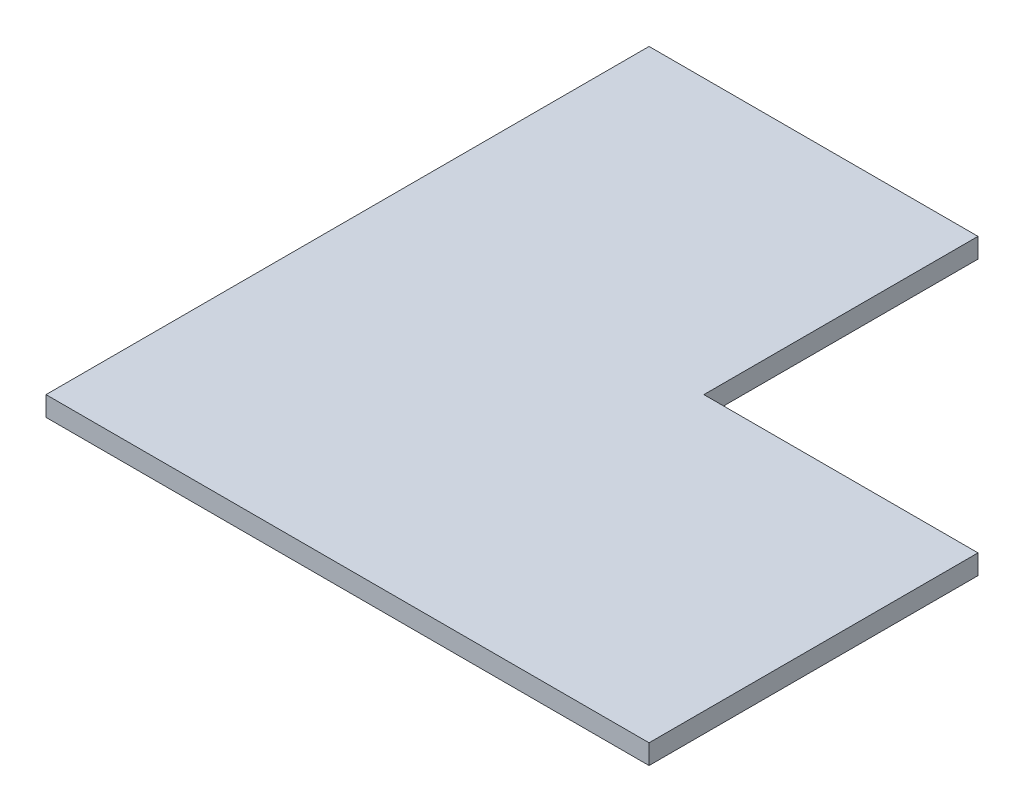
ISO-10303-21;
HEADER;
FILE_DESCRIPTION(('STEP AP214'),'2;1');
FILE_NAME('part.step','',(''),(''),'','','');
FILE_SCHEMA(('AUTOMOTIVE_DESIGN { 1 0 10303 214 1 1 1 1 }'));
ENDSEC;
DATA;
#1=APPLICATION_CONTEXT('core data for automotive mechanical design processes');
#2=APPLICATION_PROTOCOL_DEFINITION('international standard','automotive_design',2000,#1);
#3=PRODUCT_CONTEXT('',#1,'mechanical');
#4=PRODUCT('Part','Part','',(#3));
#5=PRODUCT_RELATED_PRODUCT_CATEGORY('part','',(#4));
#6=PRODUCT_DEFINITION_FORMATION('','',#4);
#7=PRODUCT_DEFINITION_CONTEXT('part definition',#1,'design');
#8=PRODUCT_DEFINITION('design','',#6,#7);
#9=PRODUCT_DEFINITION_SHAPE('','',#8);
#10=(LENGTH_UNIT() NAMED_UNIT(*) SI_UNIT(.MILLI.,.METRE.));
#11=(NAMED_UNIT(*) PLANE_ANGLE_UNIT() SI_UNIT($,.RADIAN.));
#12=(NAMED_UNIT(*) SI_UNIT($,.STERADIAN.) SOLID_ANGLE_UNIT());
#13=UNCERTAINTY_MEASURE_WITH_UNIT(LENGTH_MEASURE(1.E-05),#10,'distance_accuracy_value','');
#14=(GEOMETRIC_REPRESENTATION_CONTEXT(3) GLOBAL_UNCERTAINTY_ASSIGNED_CONTEXT((#13)) GLOBAL_UNIT_ASSIGNED_CONTEXT((#10,
#11,#12)) REPRESENTATION_CONTEXT('',''));
#15=CARTESIAN_POINT('',(0.,0.,0.));
#16=DIRECTION('',(0.,0.,1.));
#17=DIRECTION('',(1.,0.,0.));
#18=AXIS2_PLACEMENT_3D('',#15,#16,#17);
#19=CARTESIAN_POINT('',(550.,18.,0.));
#20=DIRECTION('',(0.,0.,-1.));
#21=DIRECTION('',(-1.,0.,0.));
#22=AXIS2_PLACEMENT_3D('',#19,#20,#21);
#23=PLANE('',#22);
#24=DIRECTION('',(1.,0.,0.));
#25=VECTOR('',#24,1.);
#26=CARTESIAN_POINT('',(550.,0.,0.));
#27=LINE('',#26,#25);
#28=CARTESIAN_POINT('',(0.,0.,0.));
#29=VERTEX_POINT('',#28);
#30=CARTESIAN_POINT('',(550.,0.,0.));
#31=VERTEX_POINT('',#30);
#32=EDGE_CURVE('E118',#29,#31,#27,.T.);
#33=ORIENTED_EDGE('',*,*,#32,.T.);
#34=DIRECTION('',(0.,-1.,0.));
#35=VECTOR('',#34,1.);
#36=CARTESIAN_POINT('',(550.,18.,0.));
#37=LINE('',#36,#35);
#38=CARTESIAN_POINT('',(550.,18.,0.));
#39=VERTEX_POINT('',#38);
#40=EDGE_CURVE('E11',#39,#31,#37,.T.);
#41=ORIENTED_EDGE('',*,*,#40,.F.);
#42=DIRECTION('',(1.,0.,0.));
#43=VECTOR('',#42,1.);
#44=CARTESIAN_POINT('',(550.,18.,0.));
#45=LINE('',#44,#43);
#46=CARTESIAN_POINT('',(0.,18.,0.));
#47=VERTEX_POINT('',#46);
#48=EDGE_CURVE('E128',#47,#39,#45,.T.);
#49=ORIENTED_EDGE('',*,*,#48,.F.);
#50=DIRECTION('',(0.,-1.,0.));
#51=VECTOR('',#50,1.);
#52=CARTESIAN_POINT('',(0.,18.,0.));
#53=LINE('',#52,#51);
#54=EDGE_CURVE('E114',#47,#29,#53,.T.);
#55=ORIENTED_EDGE('',*,*,#54,.T.);
#56=EDGE_LOOP('',(#33,#41,#49,#55));
#57=FACE_BOUND('',#56,.T.);
#58=ADVANCED_FACE('F34',(#57),#23,.F.);
#59=CARTESIAN_POINT('',(550.,18.,-300.));
#60=DIRECTION('',(-1.,0.,0.));
#61=DIRECTION('',(0.,0.,1.));
#62=AXIS2_PLACEMENT_3D('',#59,#60,#61);
#63=PLANE('',#62);
#64=DIRECTION('',(0.,0.,-1.));
#65=VECTOR('',#64,1.);
#66=CARTESIAN_POINT('',(550.,0.,-300.));
#67=LINE('',#66,#65);
#68=CARTESIAN_POINT('',(550.,0.,-300.));
#69=VERTEX_POINT('',#68);
#70=EDGE_CURVE('E121',#31,#69,#67,.T.);
#71=ORIENTED_EDGE('',*,*,#70,.T.);
#72=DIRECTION('',(0.,-1.,0.));
#73=VECTOR('',#72,1.);
#74=CARTESIAN_POINT('',(550.,18.,-300.));
#75=LINE('',#74,#73);
#76=CARTESIAN_POINT('',(550.,18.,-300.));
#77=VERTEX_POINT('',#76);
#78=EDGE_CURVE('E42',#77,#69,#75,.T.);
#79=ORIENTED_EDGE('',*,*,#78,.F.);
#80=DIRECTION('',(0.,0.,-1.));
#81=VECTOR('',#80,1.);
#82=CARTESIAN_POINT('',(550.,18.,-300.));
#83=LINE('',#82,#81);
#84=EDGE_CURVE('E87',#39,#77,#83,.T.);
#85=ORIENTED_EDGE('',*,*,#84,.F.);
#86=ORIENTED_EDGE('',*,*,#40,.T.);
#87=EDGE_LOOP('',(#71,#79,#85,#86));
#88=FACE_BOUND('',#87,.T.);
#89=ADVANCED_FACE('F152',(#88),#63,.F.);
#90=CARTESIAN_POINT('',(300.,18.,-300.));
#91=DIRECTION('',(0.,0.,1.));
#92=DIRECTION('',(1.,0.,0.));
#93=AXIS2_PLACEMENT_3D('',#90,#91,#92);
#94=PLANE('',#93);
#95=DIRECTION('',(-1.,0.,0.));
#96=VECTOR('',#95,1.);
#97=CARTESIAN_POINT('',(300.,0.,-300.));
#98=LINE('',#97,#96);
#99=CARTESIAN_POINT('',(300.,0.,-300.));
#100=VERTEX_POINT('',#99);
#101=EDGE_CURVE('E123',#69,#100,#98,.T.);
#102=ORIENTED_EDGE('',*,*,#101,.T.);
#103=DIRECTION('',(0.,-1.,0.));
#104=VECTOR('',#103,1.);
#105=CARTESIAN_POINT('',(300.,18.,-300.));
#106=LINE('',#105,#104);
#107=CARTESIAN_POINT('',(300.,18.,-300.));
#108=VERTEX_POINT('',#107);
#109=EDGE_CURVE('E109',#108,#100,#106,.T.);
#110=ORIENTED_EDGE('',*,*,#109,.F.);
#111=DIRECTION('',(-1.,0.,0.));
#112=VECTOR('',#111,1.);
#113=CARTESIAN_POINT('',(300.,18.,-300.));
#114=LINE('',#113,#112);
#115=EDGE_CURVE('E100',#77,#108,#114,.T.);
#116=ORIENTED_EDGE('',*,*,#115,.F.);
#117=ORIENTED_EDGE('',*,*,#78,.T.);
#118=EDGE_LOOP('',(#102,#110,#116,#117));
#119=FACE_BOUND('',#118,.T.);
#120=ADVANCED_FACE('F134',(#119),#94,.F.);
#121=CARTESIAN_POINT('',(300.,18.,-550.));
#122=DIRECTION('',(-1.,0.,0.));
#123=DIRECTION('',(0.,0.,1.));
#124=AXIS2_PLACEMENT_3D('',#121,#122,#123);
#125=PLANE('',#124);
#126=DIRECTION('',(0.,0.,-1.));
#127=VECTOR('',#126,1.);
#128=CARTESIAN_POINT('',(300.,0.,-550.));
#129=LINE('',#128,#127);
#130=CARTESIAN_POINT('',(300.,0.,-550.));
#131=VERTEX_POINT('',#130);
#132=EDGE_CURVE('E108',#100,#131,#129,.T.);
#133=ORIENTED_EDGE('',*,*,#132,.T.);
#134=DIRECTION('',(0.,-1.,0.));
#135=VECTOR('',#134,1.);
#136=CARTESIAN_POINT('',(300.,18.,-550.));
#137=LINE('',#136,#135);
#138=CARTESIAN_POINT('',(300.,18.,-550.));
#139=VERTEX_POINT('',#138);
#140=EDGE_CURVE('E105',#139,#131,#137,.T.);
#141=ORIENTED_EDGE('',*,*,#140,.F.);
#142=DIRECTION('',(0.,0.,-1.));
#143=VECTOR('',#142,1.);
#144=CARTESIAN_POINT('',(300.,18.,-550.));
#145=LINE('',#144,#143);
#146=EDGE_CURVE('E94',#108,#139,#145,.T.);
#147=ORIENTED_EDGE('',*,*,#146,.F.);
#148=ORIENTED_EDGE('',*,*,#109,.T.);
#149=EDGE_LOOP('',(#133,#141,#147,#148));
#150=FACE_BOUND('',#149,.T.);
#151=ADVANCED_FACE('F106',(#150),#125,.F.);
#152=CARTESIAN_POINT('',(0.,18.,-550.));
#153=DIRECTION('',(0.,0.,1.));
#154=DIRECTION('',(1.,0.,0.));
#155=AXIS2_PLACEMENT_3D('',#152,#153,#154);
#156=PLANE('',#155);
#157=DIRECTION('',(-1.,0.,0.));
#158=VECTOR('',#157,1.);
#159=CARTESIAN_POINT('',(0.,0.,-550.));
#160=LINE('',#159,#158);
#161=CARTESIAN_POINT('',(0.,0.,-550.));
#162=VERTEX_POINT('',#161);
#163=EDGE_CURVE('E73',#131,#162,#160,.T.);
#164=ORIENTED_EDGE('',*,*,#163,.T.);
#165=DIRECTION('',(0.,-1.,0.));
#166=VECTOR('',#165,1.);
#167=CARTESIAN_POINT('',(0.,18.,-550.));
#168=LINE('',#167,#166);
#169=CARTESIAN_POINT('',(0.,18.,-550.));
#170=VERTEX_POINT('',#169);
#171=EDGE_CURVE('E110',#170,#162,#168,.T.);
#172=ORIENTED_EDGE('',*,*,#171,.F.);
#173=DIRECTION('',(-1.,0.,0.));
#174=VECTOR('',#173,1.);
#175=CARTESIAN_POINT('',(0.,18.,-550.));
#176=LINE('',#175,#174);
#177=EDGE_CURVE('E98',#139,#170,#176,.T.);
#178=ORIENTED_EDGE('',*,*,#177,.F.);
#179=ORIENTED_EDGE('',*,*,#140,.T.);
#180=EDGE_LOOP('',(#164,#172,#178,#179));
#181=FACE_BOUND('',#180,.T.);
#182=ADVANCED_FACE('F112',(#181),#156,.F.);
#183=CARTESIAN_POINT('',(0.,18.,0.));
#184=DIRECTION('',(1.,0.,0.));
#185=DIRECTION('',(0.,0.,-1.));
#186=AXIS2_PLACEMENT_3D('',#183,#184,#185);
#187=PLANE('',#186);
#188=DIRECTION('',(0.,0.,1.));
#189=VECTOR('',#188,1.);
#190=CARTESIAN_POINT('',(0.,0.,0.));
#191=LINE('',#190,#189);
#192=EDGE_CURVE('E79',#162,#29,#191,.T.);
#193=ORIENTED_EDGE('',*,*,#192,.T.);
#194=ORIENTED_EDGE('',*,*,#54,.F.);
#195=DIRECTION('',(0.,0.,1.));
#196=VECTOR('',#195,1.);
#197=CARTESIAN_POINT('',(0.,18.,0.));
#198=LINE('',#197,#196);
#199=EDGE_CURVE('E50',#170,#47,#198,.T.);
#200=ORIENTED_EDGE('',*,*,#199,.F.);
#201=ORIENTED_EDGE('',*,*,#171,.T.);
#202=EDGE_LOOP('',(#193,#194,#200,#201));
#203=FACE_BOUND('',#202,.T.);
#204=ADVANCED_FACE('F141',(#203),#187,.F.);
#205=CARTESIAN_POINT('',(0.,18.,0.));
#206=DIRECTION('',(0.,-1.,0.));
#207=DIRECTION('',(0.,0.,-1.));
#208=AXIS2_PLACEMENT_3D('',#205,#206,#207);
#209=PLANE('',#208);
#210=ORIENTED_EDGE('',*,*,#48,.T.);
#211=ORIENTED_EDGE('',*,*,#84,.T.);
#212=ORIENTED_EDGE('',*,*,#115,.T.);
#213=ORIENTED_EDGE('',*,*,#146,.T.);
#214=ORIENTED_EDGE('',*,*,#177,.T.);
#215=ORIENTED_EDGE('',*,*,#199,.T.);
#216=EDGE_LOOP('',(#210,#211,#212,#213,#214,#215));
#217=FACE_BOUND('',#216,.T.);
#218=ADVANCED_FACE('F96',(#217),#209,.F.);
#219=CARTESIAN_POINT('',(0.,0.,0.));
#220=DIRECTION('',(0.,-1.,0.));
#221=DIRECTION('',(0.,0.,-1.));
#222=AXIS2_PLACEMENT_3D('',#219,#220,#221);
#223=PLANE('',#222);
#224=ORIENTED_EDGE('',*,*,#32,.F.);
#225=ORIENTED_EDGE('',*,*,#192,.F.);
#226=ORIENTED_EDGE('',*,*,#163,.F.);
#227=ORIENTED_EDGE('',*,*,#132,.F.);
#228=ORIENTED_EDGE('',*,*,#101,.F.);
#229=ORIENTED_EDGE('',*,*,#70,.F.);
#230=EDGE_LOOP('',(#224,#225,#226,#227,#228,#229));
#231=FACE_BOUND('',#230,.T.);
#232=ADVANCED_FACE('F137',(#231),#223,.T.);
#233=CLOSED_SHELL('',(#58,#89,#120,#151,#182,#204,#218,#232));
#234=MANIFOLD_SOLID_BREP('B2',#233);
#235=ADVANCED_BREP_SHAPE_REPRESENTATION('',(#18,#234),#14);
#236=SHAPE_DEFINITION_REPRESENTATION(#9,#235);
ENDSEC;
END-ISO-10303-21;
